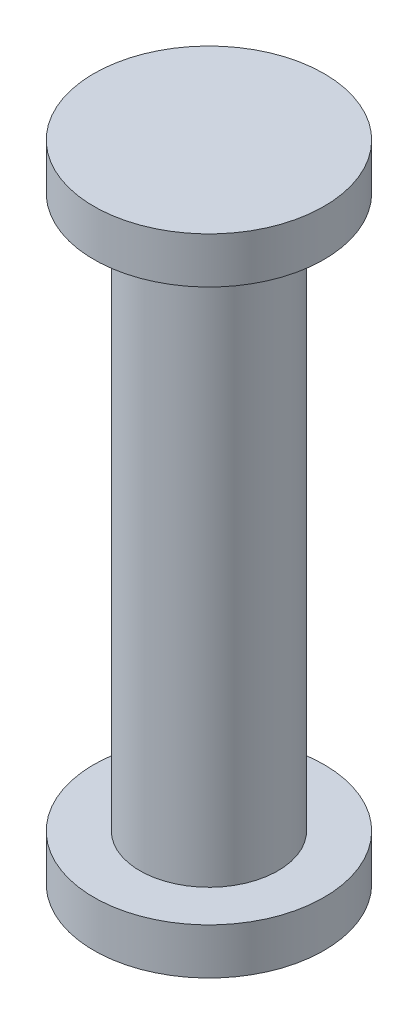
ISO-10303-21;
HEADER;
FILE_DESCRIPTION(('STEP AP214'),'2;1');
FILE_NAME('part.step','',(''),(''),'','','');
FILE_SCHEMA(('AUTOMOTIVE_DESIGN { 1 0 10303 214 1 1 1 1 }'));
ENDSEC;
DATA;
#1=APPLICATION_CONTEXT('core data for automotive mechanical design processes');
#2=APPLICATION_PROTOCOL_DEFINITION('international standard','automotive_design',2000,#1);
#3=PRODUCT_CONTEXT('',#1,'mechanical');
#4=PRODUCT('Part','Part','',(#3));
#5=PRODUCT_RELATED_PRODUCT_CATEGORY('part','',(#4));
#6=PRODUCT_DEFINITION_FORMATION('','',#4);
#7=PRODUCT_DEFINITION_CONTEXT('part definition',#1,'design');
#8=PRODUCT_DEFINITION('design','',#6,#7);
#9=PRODUCT_DEFINITION_SHAPE('','',#8);
#10=(LENGTH_UNIT() NAMED_UNIT(*) SI_UNIT(.MILLI.,.METRE.));
#11=(NAMED_UNIT(*) PLANE_ANGLE_UNIT() SI_UNIT($,.RADIAN.));
#12=(NAMED_UNIT(*) SI_UNIT($,.STERADIAN.) SOLID_ANGLE_UNIT());
#13=UNCERTAINTY_MEASURE_WITH_UNIT(LENGTH_MEASURE(1.E-05),#10,'distance_accuracy_value','');
#14=(GEOMETRIC_REPRESENTATION_CONTEXT(3) GLOBAL_UNCERTAINTY_ASSIGNED_CONTEXT((#13)) GLOBAL_UNIT_ASSIGNED_CONTEXT((#10,
#11,#12)) REPRESENTATION_CONTEXT('',''));
#15=CARTESIAN_POINT('',(0.,0.,0.));
#16=DIRECTION('',(0.,0.,1.));
#17=DIRECTION('',(1.,0.,0.));
#18=AXIS2_PLACEMENT_3D('',#15,#16,#17);
#19=CARTESIAN_POINT('',(-2.5,0.,0.));
#20=DIRECTION('',(0.,1.,0.));
#21=DIRECTION('',(0.,0.,1.));
#22=AXIS2_PLACEMENT_3D('',#19,#20,#21);
#23=PLANE('',#22);
#24=CARTESIAN_POINT('',(0.,0.,0.));
#25=DIRECTION('',(0.,-1.,0.));
#26=DIRECTION('',(0.,0.,-1.));
#27=AXIS2_PLACEMENT_3D('',#24,#25,#26);
#28=CIRCLE('',#27,2.5);
#29=CARTESIAN_POINT('',(0.,0.,-2.5));
#30=VERTEX_POINT('',#29);
#31=EDGE_CURVE('E64',#30,#30,#28,.T.);
#32=ORIENTED_EDGE('',*,*,#31,.T.);
#33=EDGE_LOOP('',(#32));
#34=FACE_BOUND('',#33,.T.);
#35=ADVANCED_FACE('F37',(#34),#23,.F.);
#36=CARTESIAN_POINT('',(0.,14.,0.));
#37=DIRECTION('',(0.,-1.,0.));
#38=DIRECTION('',(0.,0.,-1.));
#39=AXIS2_PLACEMENT_3D('',#36,#37,#38);
#40=PLANE('',#39);
#41=CARTESIAN_POINT('',(0.,14.,0.));
#42=DIRECTION('',(0.,-1.,0.));
#43=DIRECTION('',(0.,0.,-1.));
#44=AXIS2_PLACEMENT_3D('',#41,#42,#43);
#45=CIRCLE('',#44,2.5);
#46=CARTESIAN_POINT('',(0.,14.,-2.5));
#47=VERTEX_POINT('',#46);
#48=EDGE_CURVE('E10',#47,#47,#45,.T.);
#49=ORIENTED_EDGE('',*,*,#48,.F.);
#50=EDGE_LOOP('',(#49));
#51=FACE_BOUND('',#50,.T.);
#52=ADVANCED_FACE('F95',(#51),#40,.F.);
#53=CARTESIAN_POINT('',(0.,0.,0.));
#54=DIRECTION('',(0.,-1.,0.));
#55=DIRECTION('',(0.,0.,-1.));
#56=AXIS2_PLACEMENT_3D('',#53,#54,#55);
#57=CYLINDRICAL_SURFACE('',#56,2.5);
#58=CARTESIAN_POINT('',(0.,13.,0.));
#59=DIRECTION('',(0.,-1.,0.));
#60=DIRECTION('',(0.,0.,-1.));
#61=AXIS2_PLACEMENT_3D('',#58,#59,#60);
#62=CIRCLE('',#61,2.5);
#63=CARTESIAN_POINT('',(0.,13.,-2.5));
#64=VERTEX_POINT('',#63);
#65=EDGE_CURVE('E44',#64,#64,#62,.T.);
#66=ORIENTED_EDGE('',*,*,#65,.F.);
#67=EDGE_LOOP('',(#66));
#68=FACE_BOUND('',#67,.T.);
#69=ORIENTED_EDGE('',*,*,#48,.T.);
#70=EDGE_LOOP('',(#69));
#71=FACE_BOUND('',#70,.T.);
#72=ADVANCED_FACE('F90',(#68,#71),#57,.T.);
#73=CARTESIAN_POINT('',(-2.5,13.,0.));
#74=DIRECTION('',(0.,1.,0.));
#75=DIRECTION('',(0.,0.,1.));
#76=AXIS2_PLACEMENT_3D('',#73,#74,#75);
#77=PLANE('',#76);
#78=CARTESIAN_POINT('',(0.,13.,0.));
#79=DIRECTION('',(0.,-1.,0.));
#80=DIRECTION('',(0.,0.,-1.));
#81=AXIS2_PLACEMENT_3D('',#78,#79,#80);
#82=CIRCLE('',#81,1.5);
#83=CARTESIAN_POINT('',(0.,13.,-1.5));
#84=VERTEX_POINT('',#83);
#85=EDGE_CURVE('E49',#84,#84,#82,.T.);
#86=ORIENTED_EDGE('',*,*,#85,.F.);
#87=EDGE_LOOP('',(#86));
#88=FACE_BOUND('',#87,.T.);
#89=ORIENTED_EDGE('',*,*,#65,.T.);
#90=EDGE_LOOP('',(#89));
#91=FACE_BOUND('',#90,.T.);
#92=ADVANCED_FACE('F85',(#88,#91),#77,.F.);
#93=CARTESIAN_POINT('',(0.,0.,0.));
#94=DIRECTION('',(0.,-1.,0.));
#95=DIRECTION('',(0.,0.,-1.));
#96=AXIS2_PLACEMENT_3D('',#93,#94,#95);
#97=CYLINDRICAL_SURFACE('',#96,1.5);
#98=CARTESIAN_POINT('',(0.,1.,0.));
#99=DIRECTION('',(0.,-1.,0.));
#100=DIRECTION('',(0.,0.,-1.));
#101=AXIS2_PLACEMENT_3D('',#98,#99,#100);
#102=CIRCLE('',#101,1.5);
#103=CARTESIAN_POINT('',(0.,1.,-1.5));
#104=VERTEX_POINT('',#103);
#105=EDGE_CURVE('E54',#104,#104,#102,.T.);
#106=ORIENTED_EDGE('',*,*,#105,.F.);
#107=EDGE_LOOP('',(#106));
#108=FACE_BOUND('',#107,.T.);
#109=ORIENTED_EDGE('',*,*,#85,.T.);
#110=EDGE_LOOP('',(#109));
#111=FACE_BOUND('',#110,.T.);
#112=ADVANCED_FACE('F79',(#108,#111),#97,.T.);
#113=CARTESIAN_POINT('',(-1.5,1.,0.));
#114=DIRECTION('',(0.,-1.,0.));
#115=DIRECTION('',(0.,0.,-1.));
#116=AXIS2_PLACEMENT_3D('',#113,#114,#115);
#117=PLANE('',#116);
#118=CARTESIAN_POINT('',(0.,1.,0.));
#119=DIRECTION('',(0.,-1.,0.));
#120=DIRECTION('',(0.,0.,-1.));
#121=AXIS2_PLACEMENT_3D('',#118,#119,#120);
#122=CIRCLE('',#121,2.5);
#123=CARTESIAN_POINT('',(0.,1.,-2.5));
#124=VERTEX_POINT('',#123);
#125=EDGE_CURVE('E60',#124,#124,#122,.T.);
#126=ORIENTED_EDGE('',*,*,#125,.F.);
#127=EDGE_LOOP('',(#126));
#128=FACE_BOUND('',#127,.T.);
#129=ORIENTED_EDGE('',*,*,#105,.T.);
#130=EDGE_LOOP('',(#129));
#131=FACE_BOUND('',#130,.T.);
#132=ADVANCED_FACE('F73',(#128,#131),#117,.F.);
#133=CARTESIAN_POINT('',(0.,0.,0.));
#134=DIRECTION('',(0.,-1.,0.));
#135=DIRECTION('',(0.,0.,-1.));
#136=AXIS2_PLACEMENT_3D('',#133,#134,#135);
#137=CYLINDRICAL_SURFACE('',#136,2.5);
#138=ORIENTED_EDGE('',*,*,#31,.F.);
#139=EDGE_LOOP('',(#138));
#140=FACE_BOUND('',#139,.T.);
#141=ORIENTED_EDGE('',*,*,#125,.T.);
#142=EDGE_LOOP('',(#141));
#143=FACE_BOUND('',#142,.T.);
#144=ADVANCED_FACE('F70',(#140,#143),#137,.T.);
#145=CLOSED_SHELL('',(#35,#52,#72,#92,#112,#132,#144));
#146=MANIFOLD_SOLID_BREP('B2',#145);
#147=ADVANCED_BREP_SHAPE_REPRESENTATION('',(#18,#146),#14);
#148=SHAPE_DEFINITION_REPRESENTATION(#9,#147);
ENDSEC;
END-ISO-10303-21;
